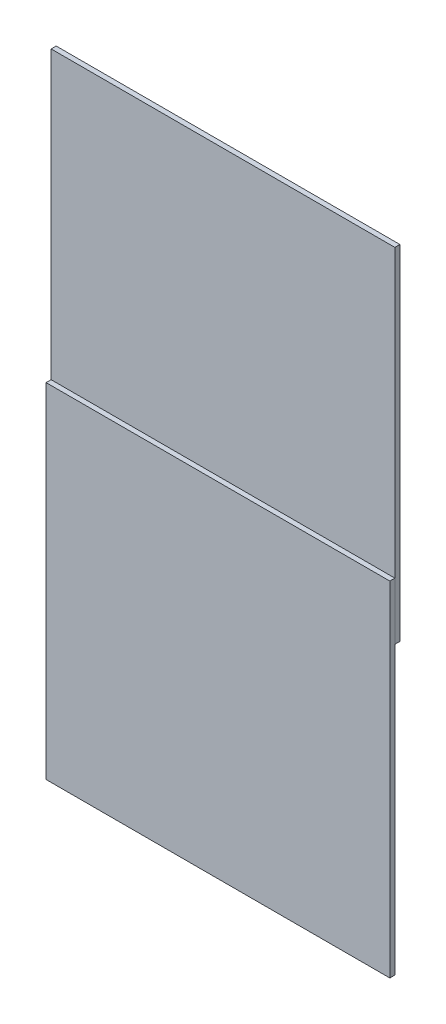
ISO-10303-21;
HEADER;
FILE_DESCRIPTION(('STEP AP214'),'2;1');
FILE_NAME('part.step','',(''),(''),'','','');
FILE_SCHEMA(('AUTOMOTIVE_DESIGN { 1 0 10303 214 1 1 1 1 }'));
ENDSEC;
DATA;
#1=APPLICATION_CONTEXT('core data for automotive mechanical design processes');
#2=APPLICATION_PROTOCOL_DEFINITION('international standard','automotive_design',2000,#1);
#3=PRODUCT_CONTEXT('',#1,'mechanical');
#4=PRODUCT('Part','Part','',(#3));
#5=PRODUCT_RELATED_PRODUCT_CATEGORY('part','',(#4));
#6=PRODUCT_DEFINITION_FORMATION('','',#4);
#7=PRODUCT_DEFINITION_CONTEXT('part definition',#1,'design');
#8=PRODUCT_DEFINITION('design','',#6,#7);
#9=PRODUCT_DEFINITION_SHAPE('','',#8);
#10=(LENGTH_UNIT() NAMED_UNIT(*) SI_UNIT(.MILLI.,.METRE.));
#11=(NAMED_UNIT(*) PLANE_ANGLE_UNIT() SI_UNIT($,.RADIAN.));
#12=(NAMED_UNIT(*) SI_UNIT($,.STERADIAN.) SOLID_ANGLE_UNIT());
#13=UNCERTAINTY_MEASURE_WITH_UNIT(LENGTH_MEASURE(1.E-05),#10,'distance_accuracy_value','');
#14=(GEOMETRIC_REPRESENTATION_CONTEXT(3) GLOBAL_UNCERTAINTY_ASSIGNED_CONTEXT((#13)) GLOBAL_UNIT_ASSIGNED_CONTEXT((#10,
#11,#12)) REPRESENTATION_CONTEXT('',''));
#15=CARTESIAN_POINT('',(0.,0.,0.));
#16=DIRECTION('',(0.,0.,1.));
#17=DIRECTION('',(1.,0.,0.));
#18=AXIS2_PLACEMENT_3D('',#15,#16,#17);
#19=CARTESIAN_POINT('',(0.,-25.,-2.2));
#20=DIRECTION('',(1.,0.,0.));
#21=DIRECTION('',(0.,0.,-1.));
#22=AXIS2_PLACEMENT_3D('',#19,#20,#21);
#23=PLANE('',#22);
#24=DIRECTION('',(0.,1.,0.));
#25=VECTOR('',#24,1.);
#26=CARTESIAN_POINT('',(0.,-25.,0.));
#27=LINE('',#26,#25);
#28=CARTESIAN_POINT('',(0.,-25.,0.));
#29=VERTEX_POINT('',#28);
#30=CARTESIAN_POINT('',(0.,125.,0.));
#31=VERTEX_POINT('',#30);
#32=EDGE_CURVE('E137',#29,#31,#27,.T.);
#33=ORIENTED_EDGE('',*,*,#32,.T.);
#34=DIRECTION('',(0.,0.,1.));
#35=VECTOR('',#34,1.);
#36=CARTESIAN_POINT('',(0.,125.,-2.2));
#37=LINE('',#36,#35);
#38=CARTESIAN_POINT('',(0.,125.,-2.2));
#39=VERTEX_POINT('',#38);
#40=EDGE_CURVE('E12',#39,#31,#37,.T.);
#41=ORIENTED_EDGE('',*,*,#40,.F.);
#42=DIRECTION('',(0.,1.,0.));
#43=VECTOR('',#42,1.);
#44=CARTESIAN_POINT('',(0.,-25.,-2.2));
#45=LINE('',#44,#43);
#46=CARTESIAN_POINT('',(0.,-25.,-2.2));
#47=VERTEX_POINT('',#46);
#48=EDGE_CURVE('E166',#47,#39,#45,.T.);
#49=ORIENTED_EDGE('',*,*,#48,.F.);
#50=DIRECTION('',(0.,0.,1.));
#51=VECTOR('',#50,1.);
#52=CARTESIAN_POINT('',(0.,-25.,-2.2));
#53=LINE('',#52,#51);
#54=EDGE_CURVE('E167',#47,#29,#53,.T.);
#55=ORIENTED_EDGE('',*,*,#54,.T.);
#56=EDGE_LOOP('',(#33,#41,#49,#55));
#57=FACE_BOUND('',#56,.T.);
#58=ADVANCED_FACE('F49',(#57),#23,.F.);
#59=CARTESIAN_POINT('',(0.,125.,-2.2));
#60=DIRECTION('',(0.,-1.,0.));
#61=DIRECTION('',(1.,0.,0.));
#62=AXIS2_PLACEMENT_3D('',#59,#60,#61);
#63=PLANE('',#62);
#64=DIRECTION('',(1.,0.,0.));
#65=VECTOR('',#64,1.);
#66=CARTESIAN_POINT('',(0.,125.,0.));
#67=LINE('',#66,#65);
#68=CARTESIAN_POINT('',(150.,125.,0.));
#69=VERTEX_POINT('',#68);
#70=EDGE_CURVE('E140',#31,#69,#67,.T.);
#71=ORIENTED_EDGE('',*,*,#70,.T.);
#72=DIRECTION('',(0.,0.,1.));
#73=VECTOR('',#72,1.);
#74=CARTESIAN_POINT('',(150.,125.,-2.2));
#75=LINE('',#74,#73);
#76=CARTESIAN_POINT('',(150.,125.,-2.2));
#77=VERTEX_POINT('',#76);
#78=EDGE_CURVE('E58',#77,#69,#75,.T.);
#79=ORIENTED_EDGE('',*,*,#78,.F.);
#80=DIRECTION('',(1.,0.,0.));
#81=VECTOR('',#80,1.);
#82=CARTESIAN_POINT('',(0.,125.,-2.2));
#83=LINE('',#82,#81);
#84=EDGE_CURVE('E190',#39,#77,#83,.T.);
#85=ORIENTED_EDGE('',*,*,#84,.F.);
#86=ORIENTED_EDGE('',*,*,#40,.T.);
#87=EDGE_LOOP('',(#71,#79,#85,#86));
#88=FACE_BOUND('',#87,.T.);
#89=ADVANCED_FACE('F218',(#88),#63,.F.);
#90=CARTESIAN_POINT('',(150.,-25.,-2.2));
#91=DIRECTION('',(-1.,0.,0.));
#92=DIRECTION('',(0.,0.,1.));
#93=AXIS2_PLACEMENT_3D('',#90,#91,#92);
#94=PLANE('',#93);
#95=DIRECTION('',(0.,-1.,0.));
#96=VECTOR('',#95,1.);
#97=CARTESIAN_POINT('',(150.,-25.,0.));
#98=LINE('',#97,#96);
#99=CARTESIAN_POINT('',(150.,-25.,0.));
#100=VERTEX_POINT('',#99);
#101=EDGE_CURVE('E162',#69,#100,#98,.T.);
#102=ORIENTED_EDGE('',*,*,#101,.T.);
#103=DIRECTION('',(0.,0.,1.));
#104=VECTOR('',#103,1.);
#105=CARTESIAN_POINT('',(150.,-25.,-2.2));
#106=LINE('',#105,#104);
#107=CARTESIAN_POINT('',(150.,-25.,-2.2));
#108=VERTEX_POINT('',#107);
#109=EDGE_CURVE('E170',#108,#100,#106,.T.);
#110=ORIENTED_EDGE('',*,*,#109,.F.);
#111=DIRECTION('',(0.,-1.,0.));
#112=VECTOR('',#111,1.);
#113=CARTESIAN_POINT('',(150.,-25.,-2.2));
#114=LINE('',#113,#112);
#115=EDGE_CURVE('E155',#77,#108,#114,.T.);
#116=ORIENTED_EDGE('',*,*,#115,.F.);
#117=ORIENTED_EDGE('',*,*,#78,.T.);
#118=EDGE_LOOP('',(#102,#110,#116,#117));
#119=FACE_BOUND('',#118,.T.);
#120=ADVANCED_FACE('F178',(#119),#94,.F.);
#121=CARTESIAN_POINT('',(0.,-25.,-2.2));
#122=DIRECTION('',(0.,1.,0.));
#123=DIRECTION('',(-1.,0.,0.));
#124=AXIS2_PLACEMENT_3D('',#121,#122,#123);
#125=PLANE('',#124);
#126=DIRECTION('',(-1.,0.,0.));
#127=VECTOR('',#126,1.);
#128=CARTESIAN_POINT('',(0.,-25.,0.));
#129=LINE('',#128,#127);
#130=EDGE_CURVE('E164',#100,#29,#129,.T.);
#131=ORIENTED_EDGE('',*,*,#130,.T.);
#132=ORIENTED_EDGE('',*,*,#54,.F.);
#133=DIRECTION('',(-1.,0.,0.));
#134=VECTOR('',#133,1.);
#135=CARTESIAN_POINT('',(0.,-25.,-2.2));
#136=LINE('',#135,#134);
#137=CARTESIAN_POINT('',(64.997224617206,-25.,-2.2));
#138=VERTEX_POINT('',#137);
#139=EDGE_CURVE('E151',#138,#47,#136,.T.);
#140=ORIENTED_EDGE('',*,*,#139,.F.);
#141=DIRECTION('',(0.,0.,1.));
#142=VECTOR('',#141,1.);
#143=CARTESIAN_POINT('',(64.997224617206,-25.,-3.2));
#144=LINE('',#143,#142);
#145=CARTESIAN_POINT('',(64.997224617206,-25.,-3.2));
#146=VERTEX_POINT('',#145);
#147=EDGE_CURVE('E121',#146,#138,#144,.T.);
#148=ORIENTED_EDGE('',*,*,#147,.F.);
#149=DIRECTION('',(-1.,0.,0.));
#150=VECTOR('',#149,1.);
#151=CARTESIAN_POINT('',(65.997224617206,-25.,-3.2));
#152=LINE('',#151,#150);
#153=CARTESIAN_POINT('',(65.997224617206,-25.,-3.2));
#154=VERTEX_POINT('',#153);
#155=EDGE_CURVE('E114',#154,#146,#152,.T.);
#156=ORIENTED_EDGE('',*,*,#155,.F.);
#157=DIRECTION('',(0.,0.,1.));
#158=VECTOR('',#157,1.);
#159=CARTESIAN_POINT('',(65.997224617206,-25.,-3.2));
#160=LINE('',#159,#158);
#161=CARTESIAN_POINT('',(65.997224617206,-25.,-2.2));
#162=VERTEX_POINT('',#161);
#163=EDGE_CURVE('E119',#154,#162,#160,.T.);
#164=ORIENTED_EDGE('',*,*,#163,.T.);
#165=EDGE_CURVE('E154',#108,#162,#136,.T.);
#166=ORIENTED_EDGE('',*,*,#165,.F.);
#167=ORIENTED_EDGE('',*,*,#109,.T.);
#168=EDGE_LOOP('',(#131,#132,#140,#148,#156,#164,#166,#167));
#169=FACE_BOUND('',#168,.T.);
#170=ADVANCED_FACE('F116',(#169),#125,.F.);
#171=CARTESIAN_POINT('',(0.,0.,-2.2));
#172=DIRECTION('',(0.,0.,-1.));
#173=DIRECTION('',(-1.,0.,0.));
#174=AXIS2_PLACEMENT_3D('',#171,#172,#173);
#175=PLANE('',#174);
#176=DIRECTION('',(0.,-1.,0.));
#177=VECTOR('',#176,1.);
#178=CARTESIAN_POINT('',(65.997224617206,-25.,-2.2));
#179=LINE('',#178,#177);
#180=CARTESIAN_POINT('',(65.997224617206,0.,-2.2));
#181=VERTEX_POINT('',#180);
#182=EDGE_CURVE('E52',#181,#162,#179,.T.);
#183=ORIENTED_EDGE('',*,*,#182,.F.);
#184=DIRECTION('',(1.,0.,0.));
#185=VECTOR('',#184,1.);
#186=CARTESIAN_POINT('',(65.997224617206,0.,-2.2));
#187=LINE('',#186,#185);
#188=CARTESIAN_POINT('',(64.997224617206,0.,-2.2));
#189=VERTEX_POINT('',#188);
#190=EDGE_CURVE('E134',#189,#181,#187,.T.);
#191=ORIENTED_EDGE('',*,*,#190,.F.);
#192=DIRECTION('',(0.,1.,0.));
#193=VECTOR('',#192,1.);
#194=CARTESIAN_POINT('',(64.997224617206,-25.,-2.2));
#195=LINE('',#194,#193);
#196=EDGE_CURVE('E71',#138,#189,#195,.T.);
#197=ORIENTED_EDGE('',*,*,#196,.F.);
#198=ORIENTED_EDGE('',*,*,#139,.T.);
#199=ORIENTED_EDGE('',*,*,#48,.T.);
#200=ORIENTED_EDGE('',*,*,#84,.T.);
#201=ORIENTED_EDGE('',*,*,#115,.T.);
#202=ORIENTED_EDGE('',*,*,#165,.T.);
#203=EDGE_LOOP('',(#183,#191,#197,#198,#199,#200,#201,#202));
#204=FACE_BOUND('',#203,.T.);
#205=ADVANCED_FACE('F205',(#204),#175,.T.);
#206=CARTESIAN_POINT('',(0.,0.,0.));
#207=DIRECTION('',(0.,0.,-1.));
#208=DIRECTION('',(-1.,0.,0.));
#209=AXIS2_PLACEMENT_3D('',#206,#207,#208);
#210=PLANE('',#209);
#211=ORIENTED_EDGE('',*,*,#32,.F.);
#212=ORIENTED_EDGE('',*,*,#130,.F.);
#213=ORIENTED_EDGE('',*,*,#101,.F.);
#214=ORIENTED_EDGE('',*,*,#70,.F.);
#215=EDGE_LOOP('',(#211,#212,#213,#214));
#216=FACE_BOUND('',#215,.T.);
#217=ADVANCED_FACE('F184',(#216),#210,.F.);
#218=CARTESIAN_POINT('',(65.997224617206,-25.,-3.2));
#219=DIRECTION('',(-1.,0.,0.));
#220=DIRECTION('',(0.,0.,1.));
#221=AXIS2_PLACEMENT_3D('',#218,#219,#220);
#222=PLANE('',#221);
#223=ORIENTED_EDGE('',*,*,#182,.T.);
#224=ORIENTED_EDGE('',*,*,#163,.F.);
#225=DIRECTION('',(0.,-1.,0.));
#226=VECTOR('',#225,1.);
#227=CARTESIAN_POINT('',(65.997224617206,-25.,-3.2));
#228=LINE('',#227,#226);
#229=CARTESIAN_POINT('',(65.997224617206,0.,-3.2));
#230=VERTEX_POINT('',#229);
#231=EDGE_CURVE('E125',#230,#154,#228,.T.);
#232=ORIENTED_EDGE('',*,*,#231,.F.);
#233=DIRECTION('',(0.,0.,1.));
#234=VECTOR('',#233,1.);
#235=CARTESIAN_POINT('',(65.997224617206,0.,-3.2));
#236=LINE('',#235,#234);
#237=EDGE_CURVE('E195',#230,#181,#236,.T.);
#238=ORIENTED_EDGE('',*,*,#237,.T.);
#239=EDGE_LOOP('',(#223,#224,#232,#238));
#240=FACE_BOUND('',#239,.T.);
#241=ADVANCED_FACE('F136',(#240),#222,.F.);
#242=CARTESIAN_POINT('',(64.997224617206,-25.,-3.2));
#243=DIRECTION('',(1.,0.,0.));
#244=DIRECTION('',(0.,0.,-1.));
#245=AXIS2_PLACEMENT_3D('',#242,#243,#244);
#246=PLANE('',#245);
#247=ORIENTED_EDGE('',*,*,#196,.T.);
#248=DIRECTION('',(0.,0.,1.));
#249=VECTOR('',#248,1.);
#250=CARTESIAN_POINT('',(64.997224617206,0.,-3.2));
#251=LINE('',#250,#249);
#252=CARTESIAN_POINT('',(64.997224617206,0.,-3.2));
#253=VERTEX_POINT('',#252);
#254=EDGE_CURVE('E142',#253,#189,#251,.T.);
#255=ORIENTED_EDGE('',*,*,#254,.F.);
#256=DIRECTION('',(0.,1.,0.));
#257=VECTOR('',#256,1.);
#258=CARTESIAN_POINT('',(64.997224617206,-25.,-3.2));
#259=LINE('',#258,#257);
#260=EDGE_CURVE('E124',#146,#253,#259,.T.);
#261=ORIENTED_EDGE('',*,*,#260,.F.);
#262=ORIENTED_EDGE('',*,*,#147,.T.);
#263=EDGE_LOOP('',(#247,#255,#261,#262));
#264=FACE_BOUND('',#263,.T.);
#265=ADVANCED_FACE('F202',(#264),#246,.F.);
#266=CARTESIAN_POINT('',(65.997224617206,0.,-3.2));
#267=DIRECTION('',(0.,-1.,0.));
#268=DIRECTION('',(0.,0.,-1.));
#269=AXIS2_PLACEMENT_3D('',#266,#267,#268);
#270=PLANE('',#269);
#271=ORIENTED_EDGE('',*,*,#190,.T.);
#272=ORIENTED_EDGE('',*,*,#237,.F.);
#273=DIRECTION('',(1.,0.,0.));
#274=VECTOR('',#273,1.);
#275=CARTESIAN_POINT('',(65.997224617206,0.,-3.2));
#276=LINE('',#275,#274);
#277=EDGE_CURVE('E130',#253,#230,#276,.T.);
#278=ORIENTED_EDGE('',*,*,#277,.F.);
#279=ORIENTED_EDGE('',*,*,#254,.T.);
#280=EDGE_LOOP('',(#271,#272,#278,#279));
#281=FACE_BOUND('',#280,.T.);
#282=ADVANCED_FACE('F204',(#281),#270,.F.);
#283=CARTESIAN_POINT('',(0.,0.,-3.2));
#284=DIRECTION('',(0.,0.,1.));
#285=DIRECTION('',(1.,0.,0.));
#286=AXIS2_PLACEMENT_3D('',#283,#284,#285);
#287=PLANE('',#286);
#288=ORIENTED_EDGE('',*,*,#231,.T.);
#289=ORIENTED_EDGE('',*,*,#155,.T.);
#290=ORIENTED_EDGE('',*,*,#260,.T.);
#291=ORIENTED_EDGE('',*,*,#277,.T.);
#292=EDGE_LOOP('',(#288,#289,#290,#291));
#293=FACE_BOUND('',#292,.T.);
#294=ADVANCED_FACE('F128',(#293),#287,.F.);
#295=CLOSED_SHELL('',(#58,#89,#120,#170,#205,#217,#241,#265,#282,#294));
#296=MANIFOLD_SOLID_BREP('B2',#295);
#297=CARTESIAN_POINT('',(0.,0.,2.2));
#298=DIRECTION('',(1.,0.,0.));
#299=DIRECTION('',(0.,1.,0.));
#300=AXIS2_PLACEMENT_3D('',#297,#298,#299);
#301=PLANE('',#300);
#302=DIRECTION('',(0.,-1.,0.));
#303=VECTOR('',#302,1.);
#304=CARTESIAN_POINT('',(0.,0.,0.));
#305=LINE('',#304,#303);
#306=CARTESIAN_POINT('',(0.,0.,0.));
#307=VERTEX_POINT('',#306);
#308=CARTESIAN_POINT('',(0.,-150.,0.));
#309=VERTEX_POINT('',#308);
#310=EDGE_CURVE('E353',#307,#309,#305,.T.);
#311=ORIENTED_EDGE('',*,*,#310,.T.);
#312=DIRECTION('',(0.,0.,-1.));
#313=VECTOR('',#312,1.);
#314=CARTESIAN_POINT('',(0.,-150.,2.2));
#315=LINE('',#314,#313);
#316=CARTESIAN_POINT('',(0.,-150.,2.2));
#317=VERTEX_POINT('',#316);
#318=EDGE_CURVE('E47',#317,#309,#315,.T.);
#319=ORIENTED_EDGE('',*,*,#318,.F.);
#320=DIRECTION('',(0.,-1.,0.));
#321=VECTOR('',#320,1.);
#322=CARTESIAN_POINT('',(0.,0.,2.2));
#323=LINE('',#322,#321);
#324=CARTESIAN_POINT('',(0.,0.,2.2));
#325=VERTEX_POINT('',#324);
#326=EDGE_CURVE('E341',#325,#317,#323,.T.);
#327=ORIENTED_EDGE('',*,*,#326,.F.);
#328=DIRECTION('',(0.,0.,-1.));
#329=VECTOR('',#328,1.);
#330=CARTESIAN_POINT('',(0.,0.,2.2));
#331=LINE('',#330,#329);
#332=EDGE_CURVE('E349',#325,#307,#331,.T.);
#333=ORIENTED_EDGE('',*,*,#332,.T.);
#334=EDGE_LOOP('',(#311,#319,#327,#333));
#335=FACE_BOUND('',#334,.T.);
#336=ADVANCED_FACE('F290',(#335),#301,.F.);
#337=CARTESIAN_POINT('',(0.,-150.,2.2));
#338=DIRECTION('',(0.,1.,0.));
#339=DIRECTION('',(0.,0.,1.));
#340=AXIS2_PLACEMENT_3D('',#337,#338,#339);
#341=PLANE('',#340);
#342=DIRECTION('',(1.,0.,0.));
#343=VECTOR('',#342,1.);
#344=CARTESIAN_POINT('',(0.,-150.,0.));
#345=LINE('',#344,#343);
#346=CARTESIAN_POINT('',(150.,-150.,0.));
#347=VERTEX_POINT('',#346);
#348=EDGE_CURVE('E345',#309,#347,#345,.T.);
#349=ORIENTED_EDGE('',*,*,#348,.T.);
#350=DIRECTION('',(0.,0.,-1.));
#351=VECTOR('',#350,1.);
#352=CARTESIAN_POINT('',(150.,-150.,2.2));
#353=LINE('',#352,#351);
#354=CARTESIAN_POINT('',(150.,-150.,2.2));
#355=VERTEX_POINT('',#354);
#356=EDGE_CURVE('E298',#355,#347,#353,.T.);
#357=ORIENTED_EDGE('',*,*,#356,.F.);
#358=DIRECTION('',(1.,0.,0.));
#359=VECTOR('',#358,1.);
#360=CARTESIAN_POINT('',(0.,-150.,2.2));
#361=LINE('',#360,#359);
#362=EDGE_CURVE('E336',#317,#355,#361,.T.);
#363=ORIENTED_EDGE('',*,*,#362,.F.);
#364=ORIENTED_EDGE('',*,*,#318,.T.);
#365=EDGE_LOOP('',(#349,#357,#363,#364));
#366=FACE_BOUND('',#365,.T.);
#367=ADVANCED_FACE('F344',(#366),#341,.F.);
#368=CARTESIAN_POINT('',(150.,0.,2.2));
#369=DIRECTION('',(-1.,0.,0.));
#370=DIRECTION('',(0.,-1.,0.));
#371=AXIS2_PLACEMENT_3D('',#368,#369,#370);
#372=PLANE('',#371);
#373=DIRECTION('',(0.,1.,0.));
#374=VECTOR('',#373,1.);
#375=CARTESIAN_POINT('',(150.,0.,0.));
#376=LINE('',#375,#374);
#377=CARTESIAN_POINT('',(150.,0.,0.));
#378=VERTEX_POINT('',#377);
#379=EDGE_CURVE('E323',#347,#378,#376,.T.);
#380=ORIENTED_EDGE('',*,*,#379,.T.);
#381=DIRECTION('',(0.,0.,-1.));
#382=VECTOR('',#381,1.);
#383=CARTESIAN_POINT('',(150.,0.,2.2));
#384=LINE('',#383,#382);
#385=CARTESIAN_POINT('',(150.,0.,2.2));
#386=VERTEX_POINT('',#385);
#387=EDGE_CURVE('E346',#386,#378,#384,.T.);
#388=ORIENTED_EDGE('',*,*,#387,.F.);
#389=DIRECTION('',(0.,1.,0.));
#390=VECTOR('',#389,1.);
#391=CARTESIAN_POINT('',(150.,0.,2.2));
#392=LINE('',#391,#390);
#393=EDGE_CURVE('E339',#355,#386,#392,.T.);
#394=ORIENTED_EDGE('',*,*,#393,.F.);
#395=ORIENTED_EDGE('',*,*,#356,.T.);
#396=EDGE_LOOP('',(#380,#388,#394,#395));
#397=FACE_BOUND('',#396,.T.);
#398=ADVANCED_FACE('F347',(#397),#372,.F.);
#399=CARTESIAN_POINT('',(0.,0.,2.2));
#400=DIRECTION('',(0.,-1.,0.));
#401=DIRECTION('',(0.,0.,-1.));
#402=AXIS2_PLACEMENT_3D('',#399,#400,#401);
#403=PLANE('',#402);
#404=DIRECTION('',(-1.,0.,0.));
#405=VECTOR('',#404,1.);
#406=CARTESIAN_POINT('',(0.,0.,0.));
#407=LINE('',#406,#405);
#408=EDGE_CURVE('E329',#378,#307,#407,.T.);
#409=ORIENTED_EDGE('',*,*,#408,.T.);
#410=ORIENTED_EDGE('',*,*,#332,.F.);
#411=DIRECTION('',(-1.,0.,0.));
#412=VECTOR('',#411,1.);
#413=CARTESIAN_POINT('',(0.,0.,2.2));
#414=LINE('',#413,#412);
#415=EDGE_CURVE('E306',#386,#325,#414,.T.);
#416=ORIENTED_EDGE('',*,*,#415,.F.);
#417=ORIENTED_EDGE('',*,*,#387,.T.);
#418=EDGE_LOOP('',(#409,#410,#416,#417));
#419=FACE_BOUND('',#418,.T.);
#420=ADVANCED_FACE('F360',(#419),#403,.F.);
#421=CARTESIAN_POINT('',(0.,0.,2.2));
#422=DIRECTION('',(0.,0.,1.));
#423=DIRECTION('',(1.,0.,0.));
#424=AXIS2_PLACEMENT_3D('',#421,#422,#423);
#425=PLANE('',#424);
#426=ORIENTED_EDGE('',*,*,#326,.T.);
#427=ORIENTED_EDGE('',*,*,#362,.T.);
#428=ORIENTED_EDGE('',*,*,#393,.T.);
#429=ORIENTED_EDGE('',*,*,#415,.T.);
#430=EDGE_LOOP('',(#426,#427,#428,#429));
#431=FACE_BOUND('',#430,.T.);
#432=ADVANCED_FACE('F337',(#431),#425,.T.);
#433=CARTESIAN_POINT('',(0.,0.,0.));
#434=DIRECTION('',(0.,0.,1.));
#435=DIRECTION('',(1.,0.,0.));
#436=AXIS2_PLACEMENT_3D('',#433,#434,#435);
#437=PLANE('',#436);
#438=ORIENTED_EDGE('',*,*,#310,.F.);
#439=ORIENTED_EDGE('',*,*,#408,.F.);
#440=ORIENTED_EDGE('',*,*,#379,.F.);
#441=ORIENTED_EDGE('',*,*,#348,.F.);
#442=EDGE_LOOP('',(#438,#439,#440,#441));
#443=FACE_BOUND('',#442,.T.);
#444=ADVANCED_FACE('F363',(#443),#437,.F.);
#445=CLOSED_SHELL('',(#336,#367,#398,#420,#432,#444));
#446=MANIFOLD_SOLID_BREP('B6',#445);
#447=ADVANCED_BREP_SHAPE_REPRESENTATION('',(#18,#296,#446),#14);
#448=SHAPE_DEFINITION_REPRESENTATION(#9,#447);
ENDSEC;
END-ISO-10303-21;
